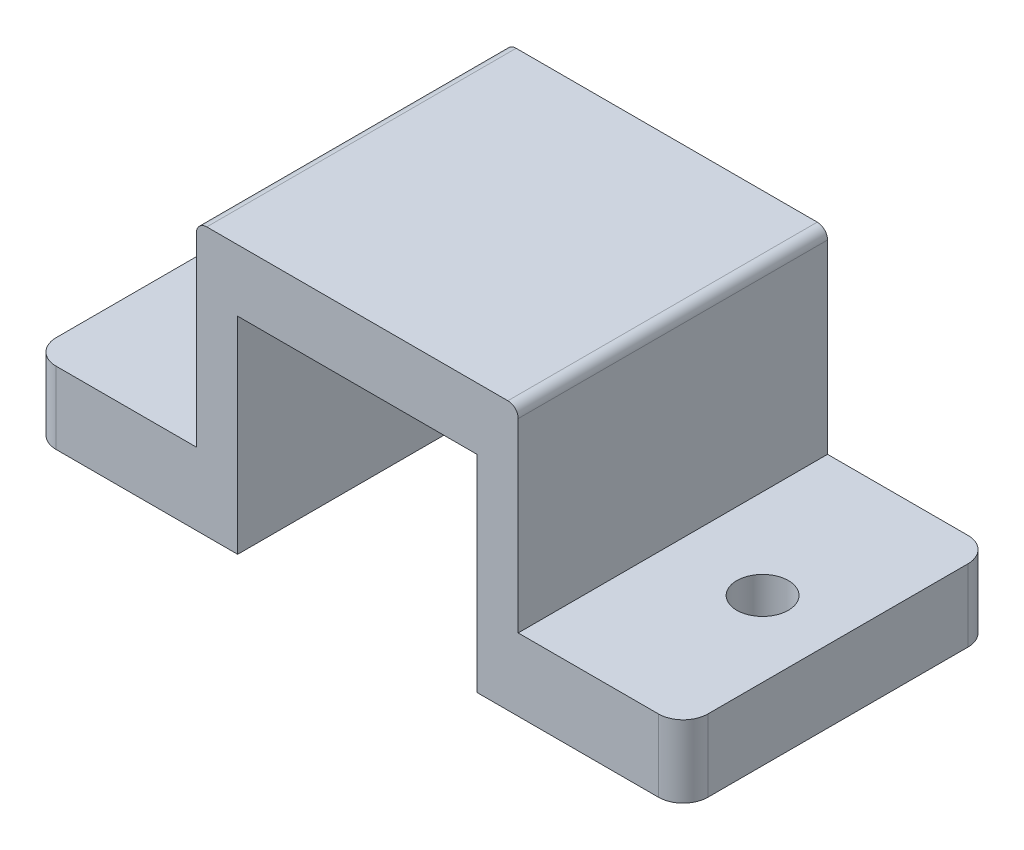
ISO-10303-21;
HEADER;
FILE_DESCRIPTION(('STEP AP214'),'2;1');
FILE_NAME('part.step','',(''),(''),'','','');
FILE_SCHEMA(('AUTOMOTIVE_DESIGN { 1 0 10303 214 1 1 1 1 }'));
ENDSEC;
DATA;
#1=APPLICATION_CONTEXT('core data for automotive mechanical design processes');
#2=APPLICATION_PROTOCOL_DEFINITION('international standard','automotive_design',2000,#1);
#3=PRODUCT_CONTEXT('',#1,'mechanical');
#4=PRODUCT('Part','Part','',(#3));
#5=PRODUCT_RELATED_PRODUCT_CATEGORY('part','',(#4));
#6=PRODUCT_DEFINITION_FORMATION('','',#4);
#7=PRODUCT_DEFINITION_CONTEXT('part definition',#1,'design');
#8=PRODUCT_DEFINITION('design','',#6,#7);
#9=PRODUCT_DEFINITION_SHAPE('','',#8);
#10=(LENGTH_UNIT() NAMED_UNIT(*) SI_UNIT(.MILLI.,.METRE.));
#11=(NAMED_UNIT(*) PLANE_ANGLE_UNIT() SI_UNIT($,.RADIAN.));
#12=(NAMED_UNIT(*) SI_UNIT($,.STERADIAN.) SOLID_ANGLE_UNIT());
#13=UNCERTAINTY_MEASURE_WITH_UNIT(LENGTH_MEASURE(1.E-05),#10,'distance_accuracy_value','');
#14=(GEOMETRIC_REPRESENTATION_CONTEXT(3) GLOBAL_UNCERTAINTY_ASSIGNED_CONTEXT((#13)) GLOBAL_UNIT_ASSIGNED_CONTEXT((#10,
#11,#12)) REPRESENTATION_CONTEXT('',''));
#15=CARTESIAN_POINT('',(0.,0.,0.));
#16=DIRECTION('',(0.,0.,1.));
#17=DIRECTION('',(1.,0.,0.));
#18=AXIS2_PLACEMENT_3D('',#15,#16,#17);
#19=CARTESIAN_POINT('',(-7.8,0.,7.5));
#20=DIRECTION('',(0.,1.,0.));
#21=DIRECTION('',(0.,0.,1.));
#22=AXIS2_PLACEMENT_3D('',#19,#20,#21);
#23=PLANE('',#22);
#24=DIRECTION('',(1.,0.,0.));
#25=VECTOR('',#24,1.);
#26=CARTESIAN_POINT('',(-7.8,0.,-7.5));
#27=LINE('',#26,#25);
#28=CARTESIAN_POINT('',(-14.6,0.,-7.5));
#29=VERTEX_POINT('',#28);
#30=CARTESIAN_POINT('',(-5.8,0.,-7.5));
#31=VERTEX_POINT('',#30);
#32=EDGE_CURVE('E250',#29,#31,#27,.T.);
#33=ORIENTED_EDGE('',*,*,#32,.T.);
#34=DIRECTION('',(0.,0.,-1.));
#35=VECTOR('',#34,1.);
#36=CARTESIAN_POINT('',(-5.8,0.,7.5));
#37=LINE('',#36,#35);
#38=CARTESIAN_POINT('',(-5.8,0.,7.5));
#39=VERTEX_POINT('',#38);
#40=EDGE_CURVE('E11',#39,#31,#37,.T.);
#41=ORIENTED_EDGE('',*,*,#40,.F.);
#42=DIRECTION('',(1.,0.,0.));
#43=VECTOR('',#42,1.);
#44=CARTESIAN_POINT('',(-7.8,0.,7.5));
#45=LINE('',#44,#43);
#46=CARTESIAN_POINT('',(-14.6,0.,7.5));
#47=VERTEX_POINT('',#46);
#48=EDGE_CURVE('E251',#47,#39,#45,.T.);
#49=ORIENTED_EDGE('',*,*,#48,.F.);
#50=CARTESIAN_POINT('',(-14.6,0.,6.3));
#51=DIRECTION('',(0.,1.,0.));
#52=DIRECTION('',(0.,0.,1.));
#53=AXIS2_PLACEMENT_3D('',#50,#51,#52);
#54=CIRCLE('',#53,1.2);
#55=CARTESIAN_POINT('',(-15.8,0.,6.29999999999999));
#56=VERTEX_POINT('',#55);
#57=EDGE_CURVE('E168',#47,#56,#54,.F.);
#58=ORIENTED_EDGE('',*,*,#57,.T.);
#59=DIRECTION('',(0.,0.,-1.));
#60=VECTOR('',#59,1.);
#61=CARTESIAN_POINT('',(-15.8,0.,0.));
#62=LINE('',#61,#60);
#63=CARTESIAN_POINT('',(-15.8,0.,-6.29999999999999));
#64=VERTEX_POINT('',#63);
#65=EDGE_CURVE('E236',#56,#64,#62,.T.);
#66=ORIENTED_EDGE('',*,*,#65,.T.);
#67=CARTESIAN_POINT('',(-14.6,0.,-6.3));
#68=DIRECTION('',(0.,1.,0.));
#69=DIRECTION('',(0.,0.,1.));
#70=AXIS2_PLACEMENT_3D('',#67,#68,#69);
#71=CIRCLE('',#70,1.2);
#72=EDGE_CURVE('E233',#29,#64,#71,.T.);
#73=ORIENTED_EDGE('',*,*,#72,.F.);
#74=EDGE_LOOP('',(#33,#41,#49,#58,#66,#73));
#75=FACE_BOUND('',#74,.T.);
#76=CARTESIAN_POINT('',(-12.15,0.,0.));
#77=DIRECTION('',(0.,1.,0.));
#78=DIRECTION('',(0.,0.,1.));
#79=AXIS2_PLACEMENT_3D('',#76,#77,#78);
#80=CIRCLE('',#79,1.25);
#81=CARTESIAN_POINT('',(-12.15,0.,1.25));
#82=VERTEX_POINT('',#81);
#83=EDGE_CURVE('E216',#82,#82,#80,.F.);
#84=ORIENTED_EDGE('',*,*,#83,.F.);
#85=EDGE_LOOP('',(#84));
#86=FACE_BOUND('',#85,.T.);
#87=ADVANCED_FACE('F32',(#75,#86),#23,.F.);
#88=CARTESIAN_POINT('',(-5.8,0.,7.5));
#89=DIRECTION('',(-1.,0.,0.));
#90=DIRECTION('',(0.,0.,1.));
#91=AXIS2_PLACEMENT_3D('',#88,#89,#90);
#92=PLANE('',#91);
#93=DIRECTION('',(0.,1.,0.));
#94=VECTOR('',#93,1.);
#95=CARTESIAN_POINT('',(-5.8,0.,-7.5));
#96=LINE('',#95,#94);
#97=CARTESIAN_POINT('',(-5.8,10.,-7.5));
#98=VERTEX_POINT('',#97);
#99=EDGE_CURVE('E275',#31,#98,#96,.T.);
#100=ORIENTED_EDGE('',*,*,#99,.T.);
#101=DIRECTION('',(0.,0.,-1.));
#102=VECTOR('',#101,1.);
#103=CARTESIAN_POINT('',(-5.8,10.,7.5));
#104=LINE('',#103,#102);
#105=CARTESIAN_POINT('',(-5.8,10.,7.5));
#106=VERTEX_POINT('',#105);
#107=EDGE_CURVE('E39',#106,#98,#104,.T.);
#108=ORIENTED_EDGE('',*,*,#107,.F.);
#109=DIRECTION('',(0.,1.,0.));
#110=VECTOR('',#109,1.);
#111=CARTESIAN_POINT('',(-5.8,0.,7.5));
#112=LINE('',#111,#110);
#113=EDGE_CURVE('E254',#39,#106,#112,.T.);
#114=ORIENTED_EDGE('',*,*,#113,.F.);
#115=ORIENTED_EDGE('',*,*,#40,.T.);
#116=EDGE_LOOP('',(#100,#108,#114,#115));
#117=FACE_BOUND('',#116,.T.);
#118=ADVANCED_FACE('F331',(#117),#92,.F.);
#119=CARTESIAN_POINT('',(-5.8,10.,7.5));
#120=DIRECTION('',(0.,1.,0.));
#121=DIRECTION('',(0.,0.,1.));
#122=AXIS2_PLACEMENT_3D('',#119,#120,#121);
#123=PLANE('',#122);
#124=DIRECTION('',(1.,0.,0.));
#125=VECTOR('',#124,1.);
#126=CARTESIAN_POINT('',(-5.8,10.,-7.5));
#127=LINE('',#126,#125);
#128=CARTESIAN_POINT('',(5.8,10.,-7.5));
#129=VERTEX_POINT('',#128);
#130=EDGE_CURVE('E277',#98,#129,#127,.T.);
#131=ORIENTED_EDGE('',*,*,#130,.T.);
#132=DIRECTION('',(0.,0.,-1.));
#133=VECTOR('',#132,1.);
#134=CARTESIAN_POINT('',(5.8,10.,7.5));
#135=LINE('',#134,#133);
#136=CARTESIAN_POINT('',(5.8,10.,7.5));
#137=VERTEX_POINT('',#136);
#138=EDGE_CURVE('E307',#137,#129,#135,.T.);
#139=ORIENTED_EDGE('',*,*,#138,.F.);
#140=DIRECTION('',(1.,0.,0.));
#141=VECTOR('',#140,1.);
#142=CARTESIAN_POINT('',(-5.8,10.,7.5));
#143=LINE('',#142,#141);
#144=EDGE_CURVE('E257',#106,#137,#143,.T.);
#145=ORIENTED_EDGE('',*,*,#144,.F.);
#146=ORIENTED_EDGE('',*,*,#107,.T.);
#147=EDGE_LOOP('',(#131,#139,#145,#146));
#148=FACE_BOUND('',#147,.T.);
#149=ADVANCED_FACE('F314',(#148),#123,.F.);
#150=CARTESIAN_POINT('',(5.8,0.,7.5));
#151=DIRECTION('',(1.,0.,0.));
#152=DIRECTION('',(0.,0.,-1.));
#153=AXIS2_PLACEMENT_3D('',#150,#151,#152);
#154=PLANE('',#153);
#155=DIRECTION('',(0.,-1.,0.));
#156=VECTOR('',#155,1.);
#157=CARTESIAN_POINT('',(5.8,0.,-7.5));
#158=LINE('',#157,#156);
#159=CARTESIAN_POINT('',(5.8,0.,-7.5));
#160=VERTEX_POINT('',#159);
#161=EDGE_CURVE('E279',#129,#160,#158,.T.);
#162=ORIENTED_EDGE('',*,*,#161,.T.);
#163=DIRECTION('',(0.,0.,-1.));
#164=VECTOR('',#163,1.);
#165=CARTESIAN_POINT('',(5.8,0.,7.5));
#166=LINE('',#165,#164);
#167=CARTESIAN_POINT('',(5.8,0.,7.5));
#168=VERTEX_POINT('',#167);
#169=EDGE_CURVE('E304',#168,#160,#166,.T.);
#170=ORIENTED_EDGE('',*,*,#169,.F.);
#171=DIRECTION('',(0.,-1.,0.));
#172=VECTOR('',#171,1.);
#173=CARTESIAN_POINT('',(5.8,0.,7.5));
#174=LINE('',#173,#172);
#175=EDGE_CURVE('E259',#137,#168,#174,.T.);
#176=ORIENTED_EDGE('',*,*,#175,.F.);
#177=ORIENTED_EDGE('',*,*,#138,.T.);
#178=EDGE_LOOP('',(#162,#170,#176,#177));
#179=FACE_BOUND('',#178,.T.);
#180=ADVANCED_FACE('F320',(#179),#154,.F.);
#181=CARTESIAN_POINT('',(7.8,0.,7.5));
#182=DIRECTION('',(0.,1.,0.));
#183=DIRECTION('',(0.,0.,1.));
#184=AXIS2_PLACEMENT_3D('',#181,#182,#183);
#185=PLANE('',#184);
#186=DIRECTION('',(1.,0.,0.));
#187=VECTOR('',#186,1.);
#188=CARTESIAN_POINT('',(7.8,0.,-7.5));
#189=LINE('',#188,#187);
#190=CARTESIAN_POINT('',(14.6,0.,-7.5));
#191=VERTEX_POINT('',#190);
#192=EDGE_CURVE('E281',#160,#191,#189,.T.);
#193=ORIENTED_EDGE('',*,*,#192,.T.);
#194=CARTESIAN_POINT('',(14.6,0.,-6.3));
#195=DIRECTION('',(0.,1.,0.));
#196=DIRECTION('',(0.,0.,1.));
#197=AXIS2_PLACEMENT_3D('',#194,#195,#196);
#198=CIRCLE('',#197,1.2);
#199=CARTESIAN_POINT('',(15.8,0.,-6.29999999999999));
#200=VERTEX_POINT('',#199);
#201=EDGE_CURVE('E164',#191,#200,#198,.F.);
#202=ORIENTED_EDGE('',*,*,#201,.T.);
#203=DIRECTION('',(0.,0.,-1.));
#204=VECTOR('',#203,1.);
#205=CARTESIAN_POINT('',(15.8,0.,0.));
#206=LINE('',#205,#204);
#207=CARTESIAN_POINT('',(15.8,0.,6.29999999999999));
#208=VERTEX_POINT('',#207);
#209=EDGE_CURVE('E203',#208,#200,#206,.T.);
#210=ORIENTED_EDGE('',*,*,#209,.F.);
#211=CARTESIAN_POINT('',(14.6,0.,6.3));
#212=DIRECTION('',(0.,1.,0.));
#213=DIRECTION('',(0.,0.,1.));
#214=AXIS2_PLACEMENT_3D('',#211,#212,#213);
#215=CIRCLE('',#214,1.2);
#216=CARTESIAN_POINT('',(14.6,0.,7.5));
#217=VERTEX_POINT('',#216);
#218=EDGE_CURVE('E200',#217,#208,#215,.T.);
#219=ORIENTED_EDGE('',*,*,#218,.F.);
#220=DIRECTION('',(1.,0.,0.));
#221=VECTOR('',#220,1.);
#222=CARTESIAN_POINT('',(7.8,0.,7.5));
#223=LINE('',#222,#221);
#224=EDGE_CURVE('E261',#168,#217,#223,.T.);
#225=ORIENTED_EDGE('',*,*,#224,.F.);
#226=ORIENTED_EDGE('',*,*,#169,.T.);
#227=EDGE_LOOP('',(#193,#202,#210,#219,#225,#226));
#228=FACE_BOUND('',#227,.T.);
#229=CARTESIAN_POINT('',(12.15,0.,0.));
#230=DIRECTION('',(0.,1.,0.));
#231=DIRECTION('',(0.,0.,1.));
#232=AXIS2_PLACEMENT_3D('',#229,#230,#231);
#233=CIRCLE('',#232,1.25);
#234=CARTESIAN_POINT('',(12.15,0.,1.25));
#235=VERTEX_POINT('',#234);
#236=EDGE_CURVE('E196',#235,#235,#233,.T.);
#237=ORIENTED_EDGE('',*,*,#236,.T.);
#238=EDGE_LOOP('',(#237));
#239=FACE_BOUND('',#238,.T.);
#240=ADVANCED_FACE('F324',(#228,#239),#185,.F.);
#241=CARTESIAN_POINT('',(7.8,0.,7.5));
#242=DIRECTION('',(-1.,0.,0.));
#243=DIRECTION('',(0.,0.,1.));
#244=AXIS2_PLACEMENT_3D('',#241,#242,#243);
#245=PLANE('',#244);
#246=DIRECTION('',(0.,1.,0.));
#247=VECTOR('',#246,1.);
#248=CARTESIAN_POINT('',(7.8,0.,7.5));
#249=LINE('',#248,#247);
#250=CARTESIAN_POINT('',(7.8,3.5,7.5));
#251=VERTEX_POINT('',#250);
#252=CARTESIAN_POINT('',(7.8,12.5,7.5));
#253=VERTEX_POINT('',#252);
#254=EDGE_CURVE('E46',#251,#253,#249,.T.);
#255=ORIENTED_EDGE('',*,*,#254,.F.);
#256=DIRECTION('',(0.,0.,1.));
#257=VECTOR('',#256,1.);
#258=CARTESIAN_POINT('',(7.8,3.5,0.));
#259=LINE('',#258,#257);
#260=CARTESIAN_POINT('',(7.8,3.5,-7.5));
#261=VERTEX_POINT('',#260);
#262=EDGE_CURVE('E184',#261,#251,#259,.T.);
#263=ORIENTED_EDGE('',*,*,#262,.F.);
#264=DIRECTION('',(0.,1.,0.));
#265=VECTOR('',#264,1.);
#266=CARTESIAN_POINT('',(7.8,0.,-7.5));
#267=LINE('',#266,#265);
#268=CARTESIAN_POINT('',(7.8,12.5,-7.5));
#269=VERTEX_POINT('',#268);
#270=EDGE_CURVE('E183',#261,#269,#267,.T.);
#271=ORIENTED_EDGE('',*,*,#270,.T.);
#272=DIRECTION('',(0.,0.,-1.));
#273=VECTOR('',#272,1.);
#274=CARTESIAN_POINT('',(7.8,12.5,7.5));
#275=LINE('',#274,#273);
#276=EDGE_CURVE('E301',#253,#269,#275,.T.);
#277=ORIENTED_EDGE('',*,*,#276,.F.);
#278=EDGE_LOOP('',(#255,#263,#271,#277));
#279=FACE_BOUND('',#278,.T.);
#280=ADVANCED_FACE('F383',(#279),#245,.F.);
#281=CARTESIAN_POINT('',(7.3,12.5,7.5));
#282=DIRECTION('',(0.,0.,-1.));
#283=DIRECTION('',(-1.,0.,0.));
#284=AXIS2_PLACEMENT_3D('',#281,#282,#283);
#285=CYLINDRICAL_SURFACE('',#284,0.5);
#286=CARTESIAN_POINT('',(7.3,12.5,-7.5));
#287=DIRECTION('',(0.,0.,1.));
#288=DIRECTION('',(1.,0.,0.));
#289=AXIS2_PLACEMENT_3D('',#286,#287,#288);
#290=CIRCLE('',#289,0.5);
#291=CARTESIAN_POINT('',(7.3,13.,-7.5));
#292=VERTEX_POINT('',#291);
#293=EDGE_CURVE('E284',#269,#292,#290,.T.);
#294=ORIENTED_EDGE('',*,*,#293,.T.);
#295=DIRECTION('',(0.,0.,-1.));
#296=VECTOR('',#295,1.);
#297=CARTESIAN_POINT('',(7.3,13.,7.5));
#298=LINE('',#297,#296);
#299=CARTESIAN_POINT('',(7.3,13.,7.5));
#300=VERTEX_POINT('',#299);
#301=EDGE_CURVE('E298',#300,#292,#298,.T.);
#302=ORIENTED_EDGE('',*,*,#301,.F.);
#303=CARTESIAN_POINT('',(7.3,12.5,7.5));
#304=DIRECTION('',(0.,0.,1.));
#305=DIRECTION('',(1.,0.,0.));
#306=AXIS2_PLACEMENT_3D('',#303,#304,#305);
#307=CIRCLE('',#306,0.5);
#308=EDGE_CURVE('E264',#253,#300,#307,.T.);
#309=ORIENTED_EDGE('',*,*,#308,.F.);
#310=ORIENTED_EDGE('',*,*,#276,.T.);
#311=EDGE_LOOP('',(#294,#302,#309,#310));
#312=FACE_BOUND('',#311,.T.);
#313=ADVANCED_FACE('F386',(#312),#285,.T.);
#314=CARTESIAN_POINT('',(-7.3,13.,7.5));
#315=DIRECTION('',(0.,-1.,0.));
#316=DIRECTION('',(0.,0.,-1.));
#317=AXIS2_PLACEMENT_3D('',#314,#315,#316);
#318=PLANE('',#317);
#319=DIRECTION('',(-1.,0.,0.));
#320=VECTOR('',#319,1.);
#321=CARTESIAN_POINT('',(-7.3,13.,-7.5));
#322=LINE('',#321,#320);
#323=CARTESIAN_POINT('',(-7.3,13.,-7.5));
#324=VERTEX_POINT('',#323);
#325=EDGE_CURVE('E287',#292,#324,#322,.T.);
#326=ORIENTED_EDGE('',*,*,#325,.T.);
#327=DIRECTION('',(0.,0.,-1.));
#328=VECTOR('',#327,1.);
#329=CARTESIAN_POINT('',(-7.3,13.,7.5));
#330=LINE('',#329,#328);
#331=CARTESIAN_POINT('',(-7.3,13.,7.5));
#332=VERTEX_POINT('',#331);
#333=EDGE_CURVE('E295',#332,#324,#330,.T.);
#334=ORIENTED_EDGE('',*,*,#333,.F.);
#335=DIRECTION('',(-1.,0.,0.));
#336=VECTOR('',#335,1.);
#337=CARTESIAN_POINT('',(5.85711697582418,13.,7.5));
#338=LINE('',#337,#336);
#339=EDGE_CURVE('E266',#300,#332,#338,.T.);
#340=ORIENTED_EDGE('',*,*,#339,.F.);
#341=ORIENTED_EDGE('',*,*,#301,.T.);
#342=EDGE_LOOP('',(#326,#334,#340,#341));
#343=FACE_BOUND('',#342,.T.);
#344=ADVANCED_FACE('F389',(#343),#318,.F.);
#345=CARTESIAN_POINT('',(-7.3,12.5,7.5));
#346=DIRECTION('',(0.,0.,-1.));
#347=DIRECTION('',(-1.,0.,0.));
#348=AXIS2_PLACEMENT_3D('',#345,#346,#347);
#349=CYLINDRICAL_SURFACE('',#348,0.5);
#350=CARTESIAN_POINT('',(-7.3,12.5,-7.5));
#351=DIRECTION('',(0.,0.,1.));
#352=DIRECTION('',(-1.,0.,0.));
#353=AXIS2_PLACEMENT_3D('',#350,#351,#352);
#354=CIRCLE('',#353,0.5);
#355=CARTESIAN_POINT('',(-7.8,12.5,-7.5));
#356=VERTEX_POINT('',#355);
#357=EDGE_CURVE('E289',#324,#356,#354,.T.);
#358=ORIENTED_EDGE('',*,*,#357,.T.);
#359=DIRECTION('',(0.,0.,-1.));
#360=VECTOR('',#359,1.);
#361=CARTESIAN_POINT('',(-7.8,12.5,7.5));
#362=LINE('',#361,#360);
#363=CARTESIAN_POINT('',(-7.8,12.5,7.5));
#364=VERTEX_POINT('',#363);
#365=EDGE_CURVE('E272',#364,#356,#362,.T.);
#366=ORIENTED_EDGE('',*,*,#365,.F.);
#367=CARTESIAN_POINT('',(-7.3,12.5,7.5));
#368=DIRECTION('',(0.,0.,1.));
#369=DIRECTION('',(-1.,0.,0.));
#370=AXIS2_PLACEMENT_3D('',#367,#368,#369);
#371=CIRCLE('',#370,0.5);
#372=EDGE_CURVE('E268',#332,#364,#371,.T.);
#373=ORIENTED_EDGE('',*,*,#372,.F.);
#374=ORIENTED_EDGE('',*,*,#333,.T.);
#375=EDGE_LOOP('',(#358,#366,#373,#374));
#376=FACE_BOUND('',#375,.T.);
#377=ADVANCED_FACE('F350',(#376),#349,.T.);
#378=CARTESIAN_POINT('',(-7.8,0.,7.5));
#379=DIRECTION('',(1.,0.,0.));
#380=DIRECTION('',(0.,0.,-1.));
#381=AXIS2_PLACEMENT_3D('',#378,#379,#380);
#382=PLANE('',#381);
#383=DIRECTION('',(0.,-1.,0.));
#384=VECTOR('',#383,1.);
#385=CARTESIAN_POINT('',(-7.8,0.,-7.5));
#386=LINE('',#385,#384);
#387=CARTESIAN_POINT('',(-7.8,3.5,-7.5));
#388=VERTEX_POINT('',#387);
#389=EDGE_CURVE('E255',#356,#388,#386,.T.);
#390=ORIENTED_EDGE('',*,*,#389,.T.);
#391=DIRECTION('',(0.,0.,1.));
#392=VECTOR('',#391,1.);
#393=CARTESIAN_POINT('',(-7.8,3.5,0.));
#394=LINE('',#393,#392);
#395=CARTESIAN_POINT('',(-7.8,3.5,7.5));
#396=VERTEX_POINT('',#395);
#397=EDGE_CURVE('E54',#388,#396,#394,.T.);
#398=ORIENTED_EDGE('',*,*,#397,.T.);
#399=DIRECTION('',(0.,-1.,0.));
#400=VECTOR('',#399,1.);
#401=CARTESIAN_POINT('',(-7.8,10.,7.5));
#402=LINE('',#401,#400);
#403=EDGE_CURVE('E270',#364,#396,#402,.T.);
#404=ORIENTED_EDGE('',*,*,#403,.F.);
#405=ORIENTED_EDGE('',*,*,#365,.T.);
#406=EDGE_LOOP('',(#390,#398,#404,#405));
#407=FACE_BOUND('',#406,.T.);
#408=ADVANCED_FACE('F353',(#407),#382,.F.);
#409=CARTESIAN_POINT('',(7.3,12.5,7.5));
#410=DIRECTION('',(0.,0.,1.));
#411=DIRECTION('',(1.,0.,0.));
#412=AXIS2_PLACEMENT_3D('',#409,#410,#411);
#413=PLANE('',#412);
#414=ORIENTED_EDGE('',*,*,#48,.T.);
#415=ORIENTED_EDGE('',*,*,#113,.T.);
#416=ORIENTED_EDGE('',*,*,#144,.T.);
#417=ORIENTED_EDGE('',*,*,#175,.T.);
#418=ORIENTED_EDGE('',*,*,#224,.T.);
#419=DIRECTION('',(0.,-1.,0.));
#420=VECTOR('',#419,1.);
#421=CARTESIAN_POINT('',(14.6,3.5,7.5));
#422=LINE('',#421,#420);
#423=CARTESIAN_POINT('',(14.6,3.5,7.5));
#424=VERTEX_POINT('',#423);
#425=EDGE_CURVE('E169',#424,#217,#422,.T.);
#426=ORIENTED_EDGE('',*,*,#425,.F.);
#427=DIRECTION('',(1.,0.,0.));
#428=VECTOR('',#427,1.);
#429=CARTESIAN_POINT('',(0.,3.5,7.5));
#430=LINE('',#429,#428);
#431=EDGE_CURVE('E186',#251,#424,#430,.T.);
#432=ORIENTED_EDGE('',*,*,#431,.F.);
#433=ORIENTED_EDGE('',*,*,#254,.T.);
#434=ORIENTED_EDGE('',*,*,#308,.T.);
#435=ORIENTED_EDGE('',*,*,#339,.T.);
#436=ORIENTED_EDGE('',*,*,#372,.T.);
#437=ORIENTED_EDGE('',*,*,#403,.T.);
#438=DIRECTION('',(-1.,0.,0.));
#439=VECTOR('',#438,1.);
#440=CARTESIAN_POINT('',(0.,3.5,7.5));
#441=LINE('',#440,#439);
#442=CARTESIAN_POINT('',(-14.6,3.5,7.5));
#443=VERTEX_POINT('',#442);
#444=EDGE_CURVE('E215',#396,#443,#441,.T.);
#445=ORIENTED_EDGE('',*,*,#444,.T.);
#446=DIRECTION('',(0.,-1.,0.));
#447=VECTOR('',#446,1.);
#448=CARTESIAN_POINT('',(-14.6,3.5,7.5));
#449=LINE('',#448,#447);
#450=EDGE_CURVE('E247',#443,#47,#449,.T.);
#451=ORIENTED_EDGE('',*,*,#450,.T.);
#452=EDGE_LOOP('',(#414,#415,#416,#417,#418,#426,#432,#433,#434,#435,#436,#437,#445,#451));
#453=FACE_BOUND('',#452,.T.);
#454=ADVANCED_FACE('F329',(#453),#413,.T.);
#455=CARTESIAN_POINT('',(7.3,12.5,-7.5));
#456=DIRECTION('',(0.,0.,1.));
#457=DIRECTION('',(1.,0.,0.));
#458=AXIS2_PLACEMENT_3D('',#455,#456,#457);
#459=PLANE('',#458);
#460=ORIENTED_EDGE('',*,*,#32,.F.);
#461=DIRECTION('',(0.,-1.,0.));
#462=VECTOR('',#461,1.);
#463=CARTESIAN_POINT('',(-14.6,3.5,-7.5));
#464=LINE('',#463,#462);
#465=CARTESIAN_POINT('',(-14.6,3.5,-7.5));
#466=VERTEX_POINT('',#465);
#467=EDGE_CURVE('E244',#466,#29,#464,.T.);
#468=ORIENTED_EDGE('',*,*,#467,.F.);
#469=DIRECTION('',(-1.,0.,0.));
#470=VECTOR('',#469,1.);
#471=CARTESIAN_POINT('',(0.,3.5,-7.5));
#472=LINE('',#471,#470);
#473=EDGE_CURVE('E220',#388,#466,#472,.T.);
#474=ORIENTED_EDGE('',*,*,#473,.F.);
#475=ORIENTED_EDGE('',*,*,#389,.F.);
#476=ORIENTED_EDGE('',*,*,#357,.F.);
#477=ORIENTED_EDGE('',*,*,#325,.F.);
#478=ORIENTED_EDGE('',*,*,#293,.F.);
#479=ORIENTED_EDGE('',*,*,#270,.F.);
#480=DIRECTION('',(1.,0.,0.));
#481=VECTOR('',#480,1.);
#482=CARTESIAN_POINT('',(0.,3.5,-7.5));
#483=LINE('',#482,#481);
#484=CARTESIAN_POINT('',(14.6,3.5,-7.5));
#485=VERTEX_POINT('',#484);
#486=EDGE_CURVE('E175',#261,#485,#483,.T.);
#487=ORIENTED_EDGE('',*,*,#486,.T.);
#488=DIRECTION('',(0.,-1.,0.));
#489=VECTOR('',#488,1.);
#490=CARTESIAN_POINT('',(14.6,3.5,-7.5));
#491=LINE('',#490,#489);
#492=EDGE_CURVE('E159',#485,#191,#491,.T.);
#493=ORIENTED_EDGE('',*,*,#492,.T.);
#494=ORIENTED_EDGE('',*,*,#192,.F.);
#495=ORIENTED_EDGE('',*,*,#161,.F.);
#496=ORIENTED_EDGE('',*,*,#130,.F.);
#497=ORIENTED_EDGE('',*,*,#99,.F.);
#498=EDGE_LOOP('',(#460,#468,#474,#475,#476,#477,#478,#479,#487,#493,#494,#495,#496,#497));
#499=FACE_BOUND('',#498,.T.);
#500=ADVANCED_FACE('F181',(#499),#459,.F.);
#501=CARTESIAN_POINT('',(-14.6,3.5,6.3));
#502=DIRECTION('',(0.,-1.,0.));
#503=DIRECTION('',(0.,0.,-1.));
#504=AXIS2_PLACEMENT_3D('',#501,#502,#503);
#505=CYLINDRICAL_SURFACE('',#504,1.2);
#506=ORIENTED_EDGE('',*,*,#57,.F.);
#507=ORIENTED_EDGE('',*,*,#450,.F.);
#508=CARTESIAN_POINT('',(-14.6,3.5,6.3));
#509=DIRECTION('',(0.,1.,0.));
#510=DIRECTION('',(0.,0.,1.));
#511=AXIS2_PLACEMENT_3D('',#508,#509,#510);
#512=CIRCLE('',#511,1.2);
#513=CARTESIAN_POINT('',(-15.8,3.5,6.29999999999999));
#514=VERTEX_POINT('',#513);
#515=EDGE_CURVE('E212',#443,#514,#512,.F.);
#516=ORIENTED_EDGE('',*,*,#515,.T.);
#517=DIRECTION('',(0.,-1.,0.));
#518=VECTOR('',#517,1.);
#519=CARTESIAN_POINT('',(-15.8,3.5,6.29999999999999));
#520=LINE('',#519,#518);
#521=EDGE_CURVE('E230',#514,#56,#520,.T.);
#522=ORIENTED_EDGE('',*,*,#521,.T.);
#523=EDGE_LOOP('',(#506,#507,#516,#522));
#524=FACE_BOUND('',#523,.T.);
#525=ADVANCED_FACE('F356',(#524),#505,.T.);
#526=CARTESIAN_POINT('',(-14.6,3.5,-6.3));
#527=DIRECTION('',(0.,-1.,0.));
#528=DIRECTION('',(0.,0.,-1.));
#529=AXIS2_PLACEMENT_3D('',#526,#527,#528);
#530=CYLINDRICAL_SURFACE('',#529,1.2);
#531=ORIENTED_EDGE('',*,*,#72,.T.);
#532=DIRECTION('',(0.,-1.,0.));
#533=VECTOR('',#532,1.);
#534=CARTESIAN_POINT('',(-15.8,3.5,-6.29999999999999));
#535=LINE('',#534,#533);
#536=CARTESIAN_POINT('',(-15.8,3.5,-6.29999999999999));
#537=VERTEX_POINT('',#536);
#538=EDGE_CURVE('E242',#537,#64,#535,.T.);
#539=ORIENTED_EDGE('',*,*,#538,.F.);
#540=CARTESIAN_POINT('',(-14.6,3.5,-6.3));
#541=DIRECTION('',(0.,1.,0.));
#542=DIRECTION('',(0.,0.,1.));
#543=AXIS2_PLACEMENT_3D('',#540,#541,#542);
#544=CIRCLE('',#543,1.2);
#545=EDGE_CURVE('E222',#466,#537,#544,.T.);
#546=ORIENTED_EDGE('',*,*,#545,.F.);
#547=ORIENTED_EDGE('',*,*,#467,.T.);
#548=EDGE_LOOP('',(#531,#539,#546,#547));
#549=FACE_BOUND('',#548,.T.);
#550=ADVANCED_FACE('F339',(#549),#530,.T.);
#551=CARTESIAN_POINT('',(-15.8,3.5,0.));
#552=DIRECTION('',(-1.,0.,0.));
#553=DIRECTION('',(0.,0.,1.));
#554=AXIS2_PLACEMENT_3D('',#551,#552,#553);
#555=PLANE('',#554);
#556=ORIENTED_EDGE('',*,*,#65,.F.);
#557=ORIENTED_EDGE('',*,*,#521,.F.);
#558=DIRECTION('',(0.,0.,-1.));
#559=VECTOR('',#558,1.);
#560=CARTESIAN_POINT('',(-15.8,3.5,0.));
#561=LINE('',#560,#559);
#562=EDGE_CURVE('E224',#514,#537,#561,.T.);
#563=ORIENTED_EDGE('',*,*,#562,.T.);
#564=ORIENTED_EDGE('',*,*,#538,.T.);
#565=EDGE_LOOP('',(#556,#557,#563,#564));
#566=FACE_BOUND('',#565,.T.);
#567=ADVANCED_FACE('F359',(#566),#555,.T.);
#568=CARTESIAN_POINT('',(-12.15,3.5,0.));
#569=DIRECTION('',(0.,-1.,0.));
#570=DIRECTION('',(0.,0.,-1.));
#571=AXIS2_PLACEMENT_3D('',#568,#569,#570);
#572=CYLINDRICAL_SURFACE('',#571,1.25);
#573=CARTESIAN_POINT('',(-12.15,3.5,0.));
#574=DIRECTION('',(0.,1.,0.));
#575=DIRECTION('',(0.,0.,1.));
#576=AXIS2_PLACEMENT_3D('',#573,#574,#575);
#577=CIRCLE('',#576,1.25);
#578=CARTESIAN_POINT('',(-12.15,3.5,1.25));
#579=VERTEX_POINT('',#578);
#580=EDGE_CURVE('E227',#579,#579,#577,.F.);
#581=ORIENTED_EDGE('',*,*,#580,.F.);
#582=EDGE_LOOP('',(#581));
#583=FACE_BOUND('',#582,.T.);
#584=ORIENTED_EDGE('',*,*,#83,.T.);
#585=EDGE_LOOP('',(#584));
#586=FACE_BOUND('',#585,.T.);
#587=ADVANCED_FACE('F361',(#583,#586),#572,.F.);
#588=CARTESIAN_POINT('',(0.,3.5,0.));
#589=DIRECTION('',(0.,1.,0.));
#590=DIRECTION('',(0.,0.,1.));
#591=AXIS2_PLACEMENT_3D('',#588,#589,#590);
#592=PLANE('',#591);
#593=ORIENTED_EDGE('',*,*,#515,.F.);
#594=ORIENTED_EDGE('',*,*,#444,.F.);
#595=ORIENTED_EDGE('',*,*,#397,.F.);
#596=ORIENTED_EDGE('',*,*,#473,.T.);
#597=ORIENTED_EDGE('',*,*,#545,.T.);
#598=ORIENTED_EDGE('',*,*,#562,.F.);
#599=EDGE_LOOP('',(#593,#594,#595,#596,#597,#598));
#600=FACE_BOUND('',#599,.T.);
#601=ORIENTED_EDGE('',*,*,#580,.T.);
#602=EDGE_LOOP('',(#601));
#603=FACE_BOUND('',#602,.T.);
#604=ADVANCED_FACE('F344',(#600,#603),#592,.T.);
#605=CARTESIAN_POINT('',(14.6,3.5,-6.3));
#606=DIRECTION('',(0.,-1.,0.));
#607=DIRECTION('',(0.,0.,-1.));
#608=AXIS2_PLACEMENT_3D('',#605,#606,#607);
#609=CYLINDRICAL_SURFACE('',#608,1.2);
#610=ORIENTED_EDGE('',*,*,#201,.F.);
#611=ORIENTED_EDGE('',*,*,#492,.F.);
#612=CARTESIAN_POINT('',(14.6,3.5,-6.3));
#613=DIRECTION('',(0.,1.,0.));
#614=DIRECTION('',(0.,0.,1.));
#615=AXIS2_PLACEMENT_3D('',#612,#613,#614);
#616=CIRCLE('',#615,1.2);
#617=CARTESIAN_POINT('',(15.8,3.5,-6.29999999999999));
#618=VERTEX_POINT('',#617);
#619=EDGE_CURVE('E162',#485,#618,#616,.F.);
#620=ORIENTED_EDGE('',*,*,#619,.T.);
#621=DIRECTION('',(0.,-1.,0.));
#622=VECTOR('',#621,1.);
#623=CARTESIAN_POINT('',(15.8,3.5,-6.29999999999999));
#624=LINE('',#623,#622);
#625=EDGE_CURVE('E195',#618,#200,#624,.T.);
#626=ORIENTED_EDGE('',*,*,#625,.T.);
#627=EDGE_LOOP('',(#610,#611,#620,#626));
#628=FACE_BOUND('',#627,.T.);
#629=ADVANCED_FACE('F161',(#628),#609,.T.);
#630=CARTESIAN_POINT('',(14.6,3.5,6.3));
#631=DIRECTION('',(0.,-1.,0.));
#632=DIRECTION('',(0.,0.,-1.));
#633=AXIS2_PLACEMENT_3D('',#630,#631,#632);
#634=CYLINDRICAL_SURFACE('',#633,1.2);
#635=ORIENTED_EDGE('',*,*,#218,.T.);
#636=DIRECTION('',(0.,-1.,0.));
#637=VECTOR('',#636,1.);
#638=CARTESIAN_POINT('',(15.8,3.5,6.29999999999999));
#639=LINE('',#638,#637);
#640=CARTESIAN_POINT('',(15.8,3.5,6.29999999999999));
#641=VERTEX_POINT('',#640);
#642=EDGE_CURVE('E207',#641,#208,#639,.T.);
#643=ORIENTED_EDGE('',*,*,#642,.F.);
#644=CARTESIAN_POINT('',(14.6,3.5,6.3));
#645=DIRECTION('',(0.,1.,0.));
#646=DIRECTION('',(0.,0.,1.));
#647=AXIS2_PLACEMENT_3D('',#644,#645,#646);
#648=CIRCLE('',#647,1.2);
#649=EDGE_CURVE('E192',#424,#641,#648,.T.);
#650=ORIENTED_EDGE('',*,*,#649,.F.);
#651=ORIENTED_EDGE('',*,*,#425,.T.);
#652=EDGE_LOOP('',(#635,#643,#650,#651));
#653=FACE_BOUND('',#652,.T.);
#654=ADVANCED_FACE('F440',(#653),#634,.T.);
#655=CARTESIAN_POINT('',(12.15,3.5,0.));
#656=DIRECTION('',(0.,-1.,0.));
#657=DIRECTION('',(0.,0.,-1.));
#658=AXIS2_PLACEMENT_3D('',#655,#656,#657);
#659=CYLINDRICAL_SURFACE('',#658,1.25);
#660=CARTESIAN_POINT('',(12.15,3.5,0.));
#661=DIRECTION('',(0.,1.,0.));
#662=DIRECTION('',(0.,0.,1.));
#663=AXIS2_PLACEMENT_3D('',#660,#661,#662);
#664=CIRCLE('',#663,1.25);
#665=CARTESIAN_POINT('',(12.15,3.5,1.25));
#666=VERTEX_POINT('',#665);
#667=EDGE_CURVE('E179',#666,#666,#664,.T.);
#668=ORIENTED_EDGE('',*,*,#667,.T.);
#669=EDGE_LOOP('',(#668));
#670=FACE_BOUND('',#669,.T.);
#671=ORIENTED_EDGE('',*,*,#236,.F.);
#672=EDGE_LOOP('',(#671));
#673=FACE_BOUND('',#672,.T.);
#674=ADVANCED_FACE('F450',(#670,#673),#659,.F.);
#675=CARTESIAN_POINT('',(15.8,3.5,0.));
#676=DIRECTION('',(-1.,0.,0.));
#677=DIRECTION('',(0.,0.,1.));
#678=AXIS2_PLACEMENT_3D('',#675,#676,#677);
#679=PLANE('',#678);
#680=ORIENTED_EDGE('',*,*,#209,.T.);
#681=ORIENTED_EDGE('',*,*,#625,.F.);
#682=DIRECTION('',(0.,0.,-1.));
#683=VECTOR('',#682,1.);
#684=CARTESIAN_POINT('',(15.8,3.5,0.));
#685=LINE('',#684,#683);
#686=EDGE_CURVE('E177',#641,#618,#685,.T.);
#687=ORIENTED_EDGE('',*,*,#686,.F.);
#688=ORIENTED_EDGE('',*,*,#642,.T.);
#689=EDGE_LOOP('',(#680,#681,#687,#688));
#690=FACE_BOUND('',#689,.T.);
#691=ADVANCED_FACE('F460',(#690),#679,.F.);
#692=CARTESIAN_POINT('',(0.,3.5,0.));
#693=DIRECTION('',(0.,1.,0.));
#694=DIRECTION('',(0.,0.,1.));
#695=AXIS2_PLACEMENT_3D('',#692,#693,#694);
#696=PLANE('',#695);
#697=ORIENTED_EDGE('',*,*,#667,.F.);
#698=EDGE_LOOP('',(#697));
#699=FACE_BOUND('',#698,.T.);
#700=ORIENTED_EDGE('',*,*,#619,.F.);
#701=ORIENTED_EDGE('',*,*,#486,.F.);
#702=ORIENTED_EDGE('',*,*,#262,.T.);
#703=ORIENTED_EDGE('',*,*,#431,.T.);
#704=ORIENTED_EDGE('',*,*,#649,.T.);
#705=ORIENTED_EDGE('',*,*,#686,.T.);
#706=EDGE_LOOP('',(#700,#701,#702,#703,#704,#705));
#707=FACE_BOUND('',#706,.T.);
#708=ADVANCED_FACE('F173',(#699,#707),#696,.T.);
#709=CLOSED_SHELL('',(#87,#118,#149,#180,#240,#280,#313,#344,#377,#408,#454,#500,#525,#550,#567,
#587,#604,#629,#654,#674,#691,#708));
#710=MANIFOLD_SOLID_BREP('B2',#709);
#711=ADVANCED_BREP_SHAPE_REPRESENTATION('',(#18,#710),#14);
#712=SHAPE_DEFINITION_REPRESENTATION(#9,#711);
ENDSEC;
END-ISO-10303-21;
